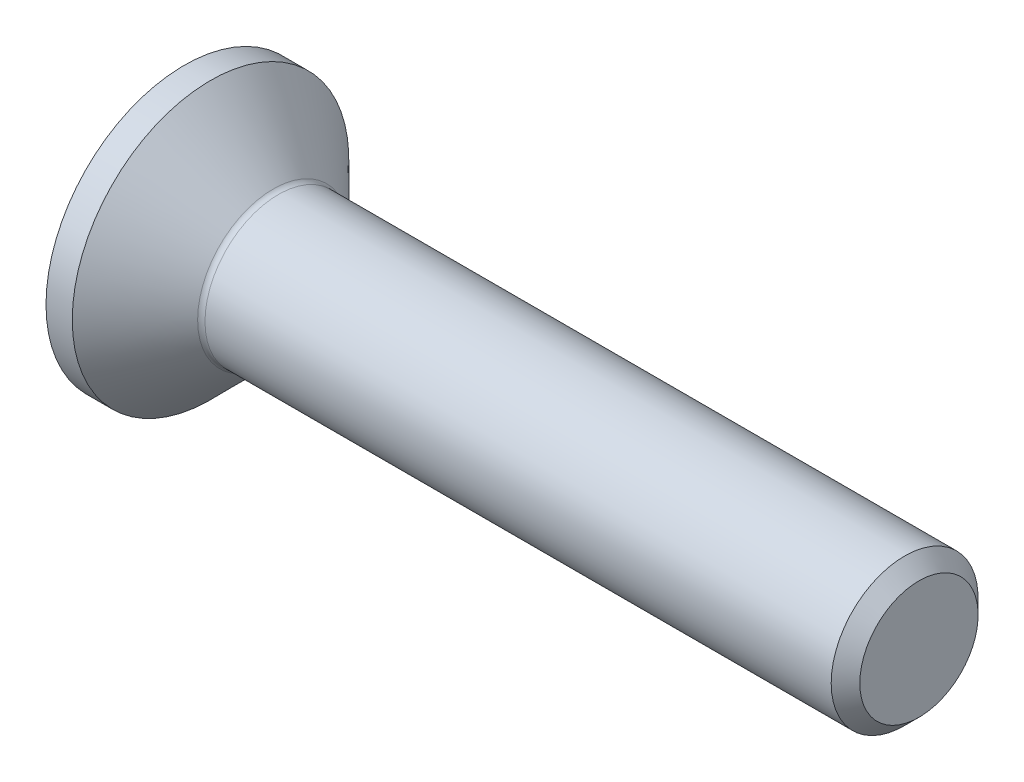
ISO-10303-21;
HEADER;
FILE_DESCRIPTION(('STEP AP214'),'2;1');
FILE_NAME('part.step','',(''),(''),'','','');
FILE_SCHEMA(('AUTOMOTIVE_DESIGN { 1 0 10303 214 1 1 1 1 }'));
ENDSEC;
DATA;
#1=APPLICATION_CONTEXT('core data for automotive mechanical design processes');
#2=APPLICATION_PROTOCOL_DEFINITION('international standard','automotive_design',2000,#1);
#3=PRODUCT_CONTEXT('',#1,'mechanical');
#4=PRODUCT('Part','Part','',(#3));
#5=PRODUCT_RELATED_PRODUCT_CATEGORY('part','',(#4));
#6=PRODUCT_DEFINITION_FORMATION('','',#4);
#7=PRODUCT_DEFINITION_CONTEXT('part definition',#1,'design');
#8=PRODUCT_DEFINITION('design','',#6,#7);
#9=PRODUCT_DEFINITION_SHAPE('','',#8);
#10=(LENGTH_UNIT() NAMED_UNIT(*) SI_UNIT(.MILLI.,.METRE.));
#11=(NAMED_UNIT(*) PLANE_ANGLE_UNIT() SI_UNIT($,.RADIAN.));
#12=(NAMED_UNIT(*) SI_UNIT($,.STERADIAN.) SOLID_ANGLE_UNIT());
#13=UNCERTAINTY_MEASURE_WITH_UNIT(LENGTH_MEASURE(1.E-05),#10,'distance_accuracy_value','');
#14=(GEOMETRIC_REPRESENTATION_CONTEXT(3) GLOBAL_UNCERTAINTY_ASSIGNED_CONTEXT((#13)) GLOBAL_UNIT_ASSIGNED_CONTEXT((#10,
#11,#12)) REPRESENTATION_CONTEXT('',''));
#15=CARTESIAN_POINT('',(0.,0.,0.));
#16=DIRECTION('',(0.,0.,1.));
#17=DIRECTION('',(1.,0.,0.));
#18=AXIS2_PLACEMENT_3D('',#15,#16,#17);
#19=CARTESIAN_POINT('',(0.,0.,0.));
#20=DIRECTION('',(-1.,0.,0.));
#21=DIRECTION('',(0.,0.,1.));
#22=AXIS2_PLACEMENT_3D('',#19,#20,#21);
#23=PLANE('',#22);
#24=CARTESIAN_POINT('',(0.,0.,0.));
#25=DIRECTION('',(-1.,0.,0.));
#26=DIRECTION('',(0.,0.,1.));
#27=AXIS2_PLACEMENT_3D('',#24,#25,#26);
#28=CIRCLE('',#27,3.765);
#29=CARTESIAN_POINT('',(0.,0.,3.765));
#30=VERTEX_POINT('',#29);
#31=EDGE_CURVE('E159',#30,#30,#28,.T.);
#32=ORIENTED_EDGE('',*,*,#31,.T.);
#33=EDGE_LOOP('',(#32));
#34=FACE_BOUND('',#33,.T.);
#35=DIRECTION('',(0.,-0.500000000000001,-0.866025403784438));
#36=VECTOR('',#35,1.);
#37=CARTESIAN_POINT('',(0.,-0.721687836487031,1.25));
#38=LINE('',#37,#36);
#39=CARTESIAN_POINT('',(0.,-0.721687836487031,1.25));
#40=VERTEX_POINT('',#39);
#41=CARTESIAN_POINT('',(0.,-1.44337567297407,0.));
#42=VERTEX_POINT('',#41);
#43=EDGE_CURVE('E121',#40,#42,#38,.T.);
#44=ORIENTED_EDGE('',*,*,#43,.T.);
#45=DIRECTION('',(0.,0.5,-0.866025403784438));
#46=VECTOR('',#45,1.);
#47=CARTESIAN_POINT('',(0.,-1.44337567297407,0.));
#48=LINE('',#47,#46);
#49=CARTESIAN_POINT('',(0.,-0.721687836487032,-1.25));
#50=VERTEX_POINT('',#49);
#51=EDGE_CURVE('E51',#42,#50,#48,.T.);
#52=ORIENTED_EDGE('',*,*,#51,.T.);
#53=DIRECTION('',(0.,1.,0.));
#54=VECTOR('',#53,1.);
#55=CARTESIAN_POINT('',(0.,-0.721687836487032,-1.25));
#56=LINE('',#55,#54);
#57=CARTESIAN_POINT('',(0.,0.721687836487033,-1.25));
#58=VERTEX_POINT('',#57);
#59=EDGE_CURVE('E136',#50,#58,#56,.T.);
#60=ORIENTED_EDGE('',*,*,#59,.T.);
#61=DIRECTION('',(0.,0.500000000000001,0.866025403784438));
#62=VECTOR('',#61,1.);
#63=CARTESIAN_POINT('',(0.,0.721687836487033,-1.25));
#64=LINE('',#63,#62);
#65=CARTESIAN_POINT('',(0.,1.44337567297407,0.));
#66=VERTEX_POINT('',#65);
#67=EDGE_CURVE('E272',#58,#66,#64,.T.);
#68=ORIENTED_EDGE('',*,*,#67,.T.);
#69=DIRECTION('',(0.,-0.5,0.866025403784438));
#70=VECTOR('',#69,1.);
#71=CARTESIAN_POINT('',(0.,1.44337567297407,0.));
#72=LINE('',#71,#70);
#73=CARTESIAN_POINT('',(0.,0.721687836487033,1.25));
#74=VERTEX_POINT('',#73);
#75=EDGE_CURVE('E275',#66,#74,#72,.T.);
#76=ORIENTED_EDGE('',*,*,#75,.T.);
#77=DIRECTION('',(0.,-1.,0.));
#78=VECTOR('',#77,1.);
#79=CARTESIAN_POINT('',(0.,0.721687836487033,1.25));
#80=LINE('',#79,#78);
#81=EDGE_CURVE('E278',#74,#40,#80,.T.);
#82=ORIENTED_EDGE('',*,*,#81,.T.);
#83=EDGE_LOOP('',(#44,#52,#60,#68,#76,#82));
#84=FACE_BOUND('',#83,.T.);
#85=ADVANCED_FACE('F36',(#34,#84),#23,.T.);
#86=CARTESIAN_POINT('',(0.,0.,0.));
#87=DIRECTION('',(-1.,0.,0.));
#88=DIRECTION('',(0.,0.,1.));
#89=AXIS2_PLACEMENT_3D('',#86,#87,#88);
#90=CYLINDRICAL_SURFACE('',#89,3.765);
#91=CARTESIAN_POINT('',(0.71500000000001,0.,0.));
#92=DIRECTION('',(-1.,0.,0.));
#93=DIRECTION('',(0.,0.,1.));
#94=AXIS2_PLACEMENT_3D('',#91,#92,#93);
#95=CIRCLE('',#94,3.765);
#96=CARTESIAN_POINT('',(0.71500000000001,0.,3.765));
#97=VERTEX_POINT('',#96);
#98=EDGE_CURVE('E156',#97,#97,#95,.T.);
#99=ORIENTED_EDGE('',*,*,#98,.T.);
#100=EDGE_LOOP('',(#99));
#101=FACE_BOUND('',#100,.T.);
#102=ORIENTED_EDGE('',*,*,#31,.F.);
#103=EDGE_LOOP('',(#102));
#104=FACE_BOUND('',#103,.T.);
#105=ADVANCED_FACE('F180',(#101,#104),#90,.T.);
#106=CARTESIAN_POINT('',(0.71500000000001,0.,0.));
#107=DIRECTION('',(-1.,0.,0.));
#108=DIRECTION('',(0.,0.,1.));
#109=AXIS2_PLACEMENT_3D('',#106,#107,#108);
#110=CONICAL_SURFACE('',#109,3.765,0.785398163397451);
#111=CARTESIAN_POINT('',(2.42142135623731,0.,0.));
#112=DIRECTION('',(-1.,0.,0.));
#113=DIRECTION('',(0.,0.,1.));
#114=AXIS2_PLACEMENT_3D('',#111,#112,#113);
#115=CIRCLE('',#114,2.05857864376269);
#116=CARTESIAN_POINT('',(2.42142135623731,0.,2.05857864376269));
#117=VERTEX_POINT('',#116);
#118=EDGE_CURVE('E44',#117,#117,#115,.T.);
#119=ORIENTED_EDGE('',*,*,#118,.T.);
#120=EDGE_LOOP('',(#119));
#121=FACE_BOUND('',#120,.T.);
#122=ORIENTED_EDGE('',*,*,#98,.F.);
#123=EDGE_LOOP('',(#122));
#124=FACE_BOUND('',#123,.T.);
#125=ADVANCED_FACE('F164',(#121,#124),#110,.T.);
#126=CARTESIAN_POINT('',(0.,0.,0.));
#127=DIRECTION('',(-1.,0.,0.));
#128=DIRECTION('',(0.,0.,1.));
#129=AXIS2_PLACEMENT_3D('',#126,#127,#128);
#130=CYLINDRICAL_SURFACE('',#129,2.);
#131=CARTESIAN_POINT('',(2.56284271247462,0.,0.));
#132=DIRECTION('',(-1.,0.,0.));
#133=DIRECTION('',(0.,0.,1.));
#134=AXIS2_PLACEMENT_3D('',#131,#132,#133);
#135=CIRCLE('',#134,2.);
#136=CARTESIAN_POINT('',(2.56284271247462,0.,2.));
#137=VERTEX_POINT('',#136);
#138=EDGE_CURVE('E11',#137,#137,#135,.F.);
#139=ORIENTED_EDGE('',*,*,#138,.T.);
#140=EDGE_LOOP('',(#139));
#141=FACE_BOUND('',#140,.T.);
#142=CARTESIAN_POINT('',(19.61,0.,0.));
#143=DIRECTION('',(-1.,0.,0.));
#144=DIRECTION('',(0.,0.,1.));
#145=AXIS2_PLACEMENT_3D('',#142,#143,#144);
#146=CIRCLE('',#145,2.);
#147=CARTESIAN_POINT('',(19.61,0.,2.));
#148=VERTEX_POINT('',#147);
#149=EDGE_CURVE('E153',#148,#148,#146,.T.);
#150=ORIENTED_EDGE('',*,*,#149,.T.);
#151=EDGE_LOOP('',(#150));
#152=FACE_BOUND('',#151,.T.);
#153=ADVANCED_FACE('F191',(#141,#152),#130,.T.);
#154=CARTESIAN_POINT('',(20.,0.,0.));
#155=DIRECTION('',(-1.,0.,0.));
#156=DIRECTION('',(0.,0.,1.));
#157=AXIS2_PLACEMENT_3D('',#154,#155,#156);
#158=CONICAL_SURFACE('',#157,1.61,0.785398163397437);
#159=ORIENTED_EDGE('',*,*,#149,.F.);
#160=EDGE_LOOP('',(#159));
#161=FACE_BOUND('',#160,.T.);
#162=CARTESIAN_POINT('',(20.,0.,0.));
#163=DIRECTION('',(-1.,0.,0.));
#164=DIRECTION('',(0.,0.,1.));
#165=AXIS2_PLACEMENT_3D('',#162,#163,#164);
#166=CIRCLE('',#165,1.61);
#167=CARTESIAN_POINT('',(20.,0.,1.61));
#168=VERTEX_POINT('',#167);
#169=EDGE_CURVE('E149',#168,#168,#166,.T.);
#170=ORIENTED_EDGE('',*,*,#169,.T.);
#171=EDGE_LOOP('',(#170));
#172=FACE_BOUND('',#171,.T.);
#173=ADVANCED_FACE('F175',(#161,#172),#158,.T.);
#174=CARTESIAN_POINT('',(20.,1.61,0.));
#175=DIRECTION('',(1.,0.,0.));
#176=DIRECTION('',(0.,0.,-1.));
#177=AXIS2_PLACEMENT_3D('',#174,#175,#176);
#178=PLANE('',#177);
#179=ORIENTED_EDGE('',*,*,#169,.F.);
#180=EDGE_LOOP('',(#179));
#181=FACE_BOUND('',#180,.T.);
#182=ADVANCED_FACE('F168',(#181),#178,.T.);
#183=CARTESIAN_POINT('',(2.56284271247462,0.,0.));
#184=DIRECTION('',(-1.,0.,0.));
#185=DIRECTION('',(0.,0.,1.));
#186=AXIS2_PLACEMENT_3D('',#183,#184,#185);
#187=TOROIDAL_SURFACE('',#186,2.2,0.2);
#188=ORIENTED_EDGE('',*,*,#138,.F.);
#189=EDGE_LOOP('',(#188));
#190=FACE_BOUND('',#189,.T.);
#191=ORIENTED_EDGE('',*,*,#118,.F.);
#192=EDGE_LOOP('',(#191));
#193=FACE_BOUND('',#192,.T.);
#194=ADVANCED_FACE('F38',(#190,#193),#187,.F.);
#195=CARTESIAN_POINT('',(1.5,-1.44337567297407,0.));
#196=DIRECTION('',(0.,0.866025403784438,0.500000000000001));
#197=DIRECTION('',(0.,-0.500000000000001,0.866025403784438));
#198=AXIS2_PLACEMENT_3D('',#195,#196,#197);
#199=PLANE('',#198);
#200=ORIENTED_EDGE('',*,*,#51,.F.);
#201=DIRECTION('',(-1.,0.,0.));
#202=VECTOR('',#201,1.);
#203=CARTESIAN_POINT('',(1.5,-1.44337567297407,0.));
#204=LINE('',#203,#202);
#205=CARTESIAN_POINT('',(1.5,-1.44337567297407,0.));
#206=VERTEX_POINT('',#205);
#207=EDGE_CURVE('E269',#206,#42,#204,.T.);
#208=ORIENTED_EDGE('',*,*,#207,.F.);
#209=DIRECTION('',(0.,0.5,-0.866025403784438));
#210=VECTOR('',#209,1.);
#211=CARTESIAN_POINT('',(1.5,-1.44337567297407,0.));
#212=LINE('',#211,#210);
#213=CARTESIAN_POINT('',(1.5,-1.08253175473055,-0.625000000000001));
#214=VERTEX_POINT('',#213);
#215=EDGE_CURVE('E118',#206,#214,#212,.T.);
#216=ORIENTED_EDGE('',*,*,#215,.T.);
#217=CARTESIAN_POINT('',(1.5,-0.721687836487032,-1.25));
#218=VERTEX_POINT('',#217);
#219=EDGE_CURVE('E112',#214,#218,#212,.T.);
#220=ORIENTED_EDGE('',*,*,#219,.T.);
#221=DIRECTION('',(-1.,0.,0.));
#222=VECTOR('',#221,1.);
#223=CARTESIAN_POINT('',(1.5,-0.721687836487032,-1.25));
#224=LINE('',#223,#222);
#225=EDGE_CURVE('E116',#218,#50,#224,.T.);
#226=ORIENTED_EDGE('',*,*,#225,.T.);
#227=EDGE_LOOP('',(#200,#208,#216,#220,#226));
#228=FACE_BOUND('',#227,.T.);
#229=ADVANCED_FACE('F114',(#228),#199,.T.);
#230=CARTESIAN_POINT('',(1.5,-0.721687836487032,-1.25));
#231=DIRECTION('',(0.,0.,1.));
#232=DIRECTION('',(0.,-1.,0.));
#233=AXIS2_PLACEMENT_3D('',#230,#231,#232);
#234=PLANE('',#233);
#235=ORIENTED_EDGE('',*,*,#59,.F.);
#236=ORIENTED_EDGE('',*,*,#225,.F.);
#237=DIRECTION('',(0.,1.,0.));
#238=VECTOR('',#237,1.);
#239=CARTESIAN_POINT('',(1.5,-0.721687836487032,-1.25));
#240=LINE('',#239,#238);
#241=CARTESIAN_POINT('',(1.5,0.,-1.25));
#242=VERTEX_POINT('',#241);
#243=EDGE_CURVE('E124',#218,#242,#240,.T.);
#244=ORIENTED_EDGE('',*,*,#243,.T.);
#245=CARTESIAN_POINT('',(1.5,0.721687836487033,-1.25));
#246=VERTEX_POINT('',#245);
#247=EDGE_CURVE('E131',#242,#246,#240,.T.);
#248=ORIENTED_EDGE('',*,*,#247,.T.);
#249=DIRECTION('',(-1.,0.,0.));
#250=VECTOR('',#249,1.);
#251=CARTESIAN_POINT('',(1.5,0.721687836487033,-1.25));
#252=LINE('',#251,#250);
#253=EDGE_CURVE('E138',#246,#58,#252,.T.);
#254=ORIENTED_EDGE('',*,*,#253,.T.);
#255=EDGE_LOOP('',(#235,#236,#244,#248,#254));
#256=FACE_BOUND('',#255,.T.);
#257=ADVANCED_FACE('F133',(#256),#234,.T.);
#258=CARTESIAN_POINT('',(1.5,0.721687836487033,-1.25));
#259=DIRECTION('',(0.,-0.866025403784438,0.5));
#260=DIRECTION('',(0.,-0.500000000000001,-0.866025403784438));
#261=AXIS2_PLACEMENT_3D('',#258,#259,#260);
#262=PLANE('',#261);
#263=ORIENTED_EDGE('',*,*,#67,.F.);
#264=ORIENTED_EDGE('',*,*,#253,.F.);
#265=DIRECTION('',(0.,0.500000000000001,0.866025403784438));
#266=VECTOR('',#265,1.);
#267=CARTESIAN_POINT('',(1.5,0.721687836487033,-1.25));
#268=LINE('',#267,#266);
#269=CARTESIAN_POINT('',(1.5,1.08253175473055,-0.625000000000001));
#270=VERTEX_POINT('',#269);
#271=EDGE_CURVE('E261',#246,#270,#268,.T.);
#272=ORIENTED_EDGE('',*,*,#271,.T.);
#273=CARTESIAN_POINT('',(1.5,1.44337567297407,0.));
#274=VERTEX_POINT('',#273);
#275=EDGE_CURVE('E130',#270,#274,#268,.T.);
#276=ORIENTED_EDGE('',*,*,#275,.T.);
#277=DIRECTION('',(-1.,0.,0.));
#278=VECTOR('',#277,1.);
#279=CARTESIAN_POINT('',(1.5,1.44337567297407,0.));
#280=LINE('',#279,#278);
#281=EDGE_CURVE('E144',#274,#66,#280,.T.);
#282=ORIENTED_EDGE('',*,*,#281,.T.);
#283=EDGE_LOOP('',(#263,#264,#272,#276,#282));
#284=FACE_BOUND('',#283,.T.);
#285=ADVANCED_FACE('F205',(#284),#262,.T.);
#286=CARTESIAN_POINT('',(1.5,1.44337567297407,0.));
#287=DIRECTION('',(0.,-0.866025403784439,-0.5));
#288=DIRECTION('',(0.,0.5,-0.866025403784439));
#289=AXIS2_PLACEMENT_3D('',#286,#287,#288);
#290=PLANE('',#289);
#291=ORIENTED_EDGE('',*,*,#75,.F.);
#292=ORIENTED_EDGE('',*,*,#281,.F.);
#293=DIRECTION('',(0.,-0.5,0.866025403784438));
#294=VECTOR('',#293,1.);
#295=CARTESIAN_POINT('',(1.5,1.44337567297407,0.));
#296=LINE('',#295,#294);
#297=CARTESIAN_POINT('',(1.5,1.08253175473055,0.625));
#298=VERTEX_POINT('',#297);
#299=EDGE_CURVE('E59',#274,#298,#296,.T.);
#300=ORIENTED_EDGE('',*,*,#299,.T.);
#301=CARTESIAN_POINT('',(1.5,0.721687836487033,1.25));
#302=VERTEX_POINT('',#301);
#303=EDGE_CURVE('E240',#298,#302,#296,.T.);
#304=ORIENTED_EDGE('',*,*,#303,.T.);
#305=DIRECTION('',(-1.,0.,0.));
#306=VECTOR('',#305,1.);
#307=CARTESIAN_POINT('',(1.5,0.721687836487033,1.25));
#308=LINE('',#307,#306);
#309=EDGE_CURVE('E254',#302,#74,#308,.T.);
#310=ORIENTED_EDGE('',*,*,#309,.T.);
#311=EDGE_LOOP('',(#291,#292,#300,#304,#310));
#312=FACE_BOUND('',#311,.T.);
#313=ADVANCED_FACE('F208',(#312),#290,.T.);
#314=CARTESIAN_POINT('',(1.5,0.721687836487033,1.25));
#315=DIRECTION('',(0.,0.,-1.));
#316=DIRECTION('',(-1.,0.,0.));
#317=AXIS2_PLACEMENT_3D('',#314,#315,#316);
#318=PLANE('',#317);
#319=ORIENTED_EDGE('',*,*,#81,.F.);
#320=ORIENTED_EDGE('',*,*,#309,.F.);
#321=DIRECTION('',(0.,-1.,0.));
#322=VECTOR('',#321,1.);
#323=CARTESIAN_POINT('',(1.5,0.721687836487033,1.25));
#324=LINE('',#323,#322);
#325=CARTESIAN_POINT('',(1.5,0.,1.25));
#326=VERTEX_POINT('',#325);
#327=EDGE_CURVE('E239',#302,#326,#324,.T.);
#328=ORIENTED_EDGE('',*,*,#327,.T.);
#329=CARTESIAN_POINT('',(1.5,-0.721687836487031,1.25));
#330=VERTEX_POINT('',#329);
#331=EDGE_CURVE('E245',#326,#330,#324,.T.);
#332=ORIENTED_EDGE('',*,*,#331,.T.);
#333=DIRECTION('',(-1.,0.,0.));
#334=VECTOR('',#333,1.);
#335=CARTESIAN_POINT('',(1.5,-0.721687836487031,1.25));
#336=LINE('',#335,#334);
#337=EDGE_CURVE('E284',#330,#40,#336,.T.);
#338=ORIENTED_EDGE('',*,*,#337,.T.);
#339=EDGE_LOOP('',(#319,#320,#328,#332,#338));
#340=FACE_BOUND('',#339,.T.);
#341=ADVANCED_FACE('F212',(#340),#318,.T.);
#342=CARTESIAN_POINT('',(1.5,-0.721687836487031,1.25));
#343=DIRECTION('',(0.,0.866025403784438,-0.500000000000001));
#344=DIRECTION('',(0.,0.500000000000001,0.866025403784438));
#345=AXIS2_PLACEMENT_3D('',#342,#343,#344);
#346=PLANE('',#345);
#347=ORIENTED_EDGE('',*,*,#43,.F.);
#348=ORIENTED_EDGE('',*,*,#337,.F.);
#349=DIRECTION('',(0.,-0.500000000000001,-0.866025403784438));
#350=VECTOR('',#349,1.);
#351=CARTESIAN_POINT('',(1.5,-0.721687836487031,1.25));
#352=LINE('',#351,#350);
#353=CARTESIAN_POINT('',(1.5,-1.08253175473055,0.625000000000002));
#354=VERTEX_POINT('',#353);
#355=EDGE_CURVE('E248',#330,#354,#352,.T.);
#356=ORIENTED_EDGE('',*,*,#355,.T.);
#357=EDGE_CURVE('E255',#354,#206,#352,.T.);
#358=ORIENTED_EDGE('',*,*,#357,.T.);
#359=ORIENTED_EDGE('',*,*,#207,.T.);
#360=EDGE_LOOP('',(#347,#348,#356,#358,#359));
#361=FACE_BOUND('',#360,.T.);
#362=ADVANCED_FACE('F215',(#361),#346,.T.);
#363=CARTESIAN_POINT('',(1.5,-1.44337567297407,0.));
#364=DIRECTION('',(-1.,0.,0.));
#365=DIRECTION('',(0.,0.,1.));
#366=AXIS2_PLACEMENT_3D('',#363,#364,#365);
#367=PLANE('',#366);
#368=CARTESIAN_POINT('',(1.5,0.,0.));
#369=DIRECTION('',(-1.,0.,0.));
#370=DIRECTION('',(0.,0.,1.));
#371=AXIS2_PLACEMENT_3D('',#368,#369,#370);
#372=CIRCLE('',#371,1.25);
#373=EDGE_CURVE('E137',#354,#326,#372,.T.);
#374=ORIENTED_EDGE('',*,*,#373,.F.);
#375=ORIENTED_EDGE('',*,*,#355,.F.);
#376=ORIENTED_EDGE('',*,*,#331,.F.);
#377=EDGE_LOOP('',(#374,#375,#376));
#378=FACE_BOUND('',#377,.T.);
#379=ADVANCED_FACE('F219',(#378),#367,.T.);
#380=EDGE_CURVE('E141',#214,#354,#372,.T.);
#381=ORIENTED_EDGE('',*,*,#380,.F.);
#382=ORIENTED_EDGE('',*,*,#215,.F.);
#383=ORIENTED_EDGE('',*,*,#357,.F.);
#384=EDGE_LOOP('',(#381,#382,#383));
#385=FACE_BOUND('',#384,.T.);
#386=ADVANCED_FACE('F222',(#385),#367,.T.);
#387=EDGE_CURVE('E126',#242,#214,#372,.T.);
#388=ORIENTED_EDGE('',*,*,#387,.F.);
#389=ORIENTED_EDGE('',*,*,#243,.F.);
#390=ORIENTED_EDGE('',*,*,#219,.F.);
#391=EDGE_LOOP('',(#388,#389,#390));
#392=FACE_BOUND('',#391,.T.);
#393=ADVANCED_FACE('F125',(#392),#367,.T.);
#394=EDGE_CURVE('E257',#270,#242,#372,.T.);
#395=ORIENTED_EDGE('',*,*,#394,.F.);
#396=ORIENTED_EDGE('',*,*,#271,.F.);
#397=ORIENTED_EDGE('',*,*,#247,.F.);
#398=EDGE_LOOP('',(#395,#396,#397));
#399=FACE_BOUND('',#398,.T.);
#400=ADVANCED_FACE('F234',(#399),#367,.T.);
#401=EDGE_CURVE('E150',#298,#270,#372,.T.);
#402=ORIENTED_EDGE('',*,*,#401,.F.);
#403=ORIENTED_EDGE('',*,*,#299,.F.);
#404=ORIENTED_EDGE('',*,*,#275,.F.);
#405=EDGE_LOOP('',(#402,#403,#404));
#406=FACE_BOUND('',#405,.T.);
#407=ADVANCED_FACE('F229',(#406),#367,.T.);
#408=EDGE_CURVE('E143',#326,#298,#372,.T.);
#409=ORIENTED_EDGE('',*,*,#408,.F.);
#410=ORIENTED_EDGE('',*,*,#327,.F.);
#411=ORIENTED_EDGE('',*,*,#303,.F.);
#412=EDGE_LOOP('',(#409,#410,#411));
#413=FACE_BOUND('',#412,.T.);
#414=ADVANCED_FACE('F200',(#413),#367,.T.);
#415=CARTESIAN_POINT('',(1.5,0.,0.));
#416=DIRECTION('',(-1.,0.,0.));
#417=DIRECTION('',(0.,0.,1.));
#418=AXIS2_PLACEMENT_3D('',#415,#416,#417);
#419=CONICAL_SURFACE('',#418,1.25,1.04719755119659);
#420=CARTESIAN_POINT('',(2.22168783648704,0.,0.));
#421=VERTEX_POINT('',#420);
#422=VERTEX_LOOP('',#421);
#423=FACE_BOUND('',#422,.T.);
#424=ORIENTED_EDGE('',*,*,#408,.T.);
#425=ORIENTED_EDGE('',*,*,#401,.T.);
#426=ORIENTED_EDGE('',*,*,#394,.T.);
#427=ORIENTED_EDGE('',*,*,#387,.T.);
#428=ORIENTED_EDGE('',*,*,#380,.T.);
#429=ORIENTED_EDGE('',*,*,#373,.T.);
#430=EDGE_LOOP('',(#424,#425,#426,#427,#428,#429));
#431=FACE_BOUND('',#430,.T.);
#432=ADVANCED_FACE('F198',(#423,#431),#419,.F.);
#433=CLOSED_SHELL('',(#85,#105,#125,#153,#173,#182,#194,#229,#257,#285,#313,#341,#362,#379,#386,
#393,#400,#407,#414,#432));
#434=MANIFOLD_SOLID_BREP('B2',#433);
#435=ADVANCED_BREP_SHAPE_REPRESENTATION('',(#18,#434),#14);
#436=SHAPE_DEFINITION_REPRESENTATION(#9,#435);
ENDSEC;
END-ISO-10303-21;
